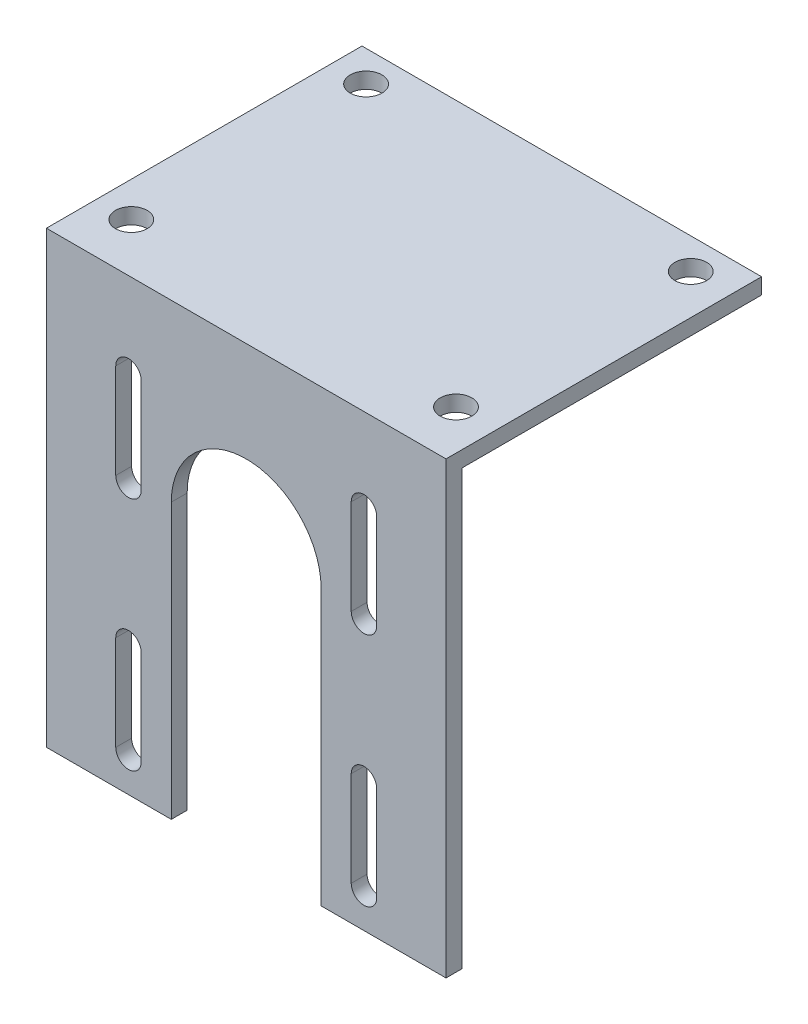
ISO-10303-21;
HEADER;
FILE_DESCRIPTION(('STEP AP214'),'2;1');
FILE_NAME('part.step','',(''),(''),'','','');
FILE_SCHEMA(('AUTOMOTIVE_DESIGN { 1 0 10303 214 1 1 1 1 }'));
ENDSEC;
DATA;
#1=APPLICATION_CONTEXT('core data for automotive mechanical design processes');
#2=APPLICATION_PROTOCOL_DEFINITION('international standard','automotive_design',2000,#1);
#3=PRODUCT_CONTEXT('',#1,'mechanical');
#4=PRODUCT('Part','Part','',(#3));
#5=PRODUCT_RELATED_PRODUCT_CATEGORY('part','',(#4));
#6=PRODUCT_DEFINITION_FORMATION('','',#4);
#7=PRODUCT_DEFINITION_CONTEXT('part definition',#1,'design');
#8=PRODUCT_DEFINITION('design','',#6,#7);
#9=PRODUCT_DEFINITION_SHAPE('','',#8);
#10=(LENGTH_UNIT() NAMED_UNIT(*) SI_UNIT(.MILLI.,.METRE.));
#11=(NAMED_UNIT(*) PLANE_ANGLE_UNIT() SI_UNIT($,.RADIAN.));
#12=(NAMED_UNIT(*) SI_UNIT($,.STERADIAN.) SOLID_ANGLE_UNIT());
#13=UNCERTAINTY_MEASURE_WITH_UNIT(LENGTH_MEASURE(1.E-05),#10,'distance_accuracy_value','');
#14=(GEOMETRIC_REPRESENTATION_CONTEXT(3) GLOBAL_UNCERTAINTY_ASSIGNED_CONTEXT((#13)) GLOBAL_UNIT_ASSIGNED_CONTEXT((#10,
#11,#12)) REPRESENTATION_CONTEXT('',''));
#15=CARTESIAN_POINT('',(0.,0.,0.));
#16=DIRECTION('',(0.,0.,1.));
#17=DIRECTION('',(1.,0.,0.));
#18=AXIS2_PLACEMENT_3D('',#15,#16,#17);
#19=CARTESIAN_POINT('',(0.,0.,3.175));
#20=DIRECTION('',(0.,0.,-1.));
#21=DIRECTION('',(-1.,0.,0.));
#22=AXIS2_PLACEMENT_3D('',#19,#20,#21);
#23=PLANE('',#22);
#24=CARTESIAN_POINT('',(16.43,-83.07,3.175));
#25=DIRECTION('',(0.,0.,1.));
#26=DIRECTION('',(-1.,0.,0.));
#27=AXIS2_PLACEMENT_3D('',#24,#25,#26);
#28=CIRCLE('',#27,2.54999999999997);
#29=CARTESIAN_POINT('',(13.88,-83.07,3.175));
#30=VERTEX_POINT('',#29);
#31=CARTESIAN_POINT('',(18.98,-83.07,3.175));
#32=VERTEX_POINT('',#31);
#33=EDGE_CURVE('E326',#30,#32,#28,.T.);
#34=ORIENTED_EDGE('',*,*,#33,.F.);
#35=DIRECTION('',(0.,-1.,0.));
#36=VECTOR('',#35,1.);
#37=CARTESIAN_POINT('',(13.88,-83.07,3.175));
#38=LINE('',#37,#36);
#39=CARTESIAN_POINT('',(13.88,-64.07,3.175));
#40=VERTEX_POINT('',#39);
#41=EDGE_CURVE('E334',#40,#30,#38,.T.);
#42=ORIENTED_EDGE('',*,*,#41,.F.);
#43=CARTESIAN_POINT('',(16.43,-64.07,3.175));
#44=DIRECTION('',(0.,0.,1.));
#45=DIRECTION('',(-1.,0.,0.));
#46=AXIS2_PLACEMENT_3D('',#43,#44,#45);
#47=CIRCLE('',#46,2.54999999999997);
#48=CARTESIAN_POINT('',(18.98,-64.07,3.175));
#49=VERTEX_POINT('',#48);
#50=EDGE_CURVE('E331',#49,#40,#47,.T.);
#51=ORIENTED_EDGE('',*,*,#50,.F.);
#52=DIRECTION('',(0.,1.,0.));
#53=VECTOR('',#52,1.);
#54=CARTESIAN_POINT('',(18.98,-83.07,3.175));
#55=LINE('',#54,#53);
#56=EDGE_CURVE('E328',#32,#49,#55,.T.);
#57=ORIENTED_EDGE('',*,*,#56,.F.);
#58=EDGE_LOOP('',(#34,#42,#51,#57));
#59=FACE_BOUND('',#58,.T.);
#60=CARTESIAN_POINT('',(16.43,-16.93,3.175));
#61=DIRECTION('',(0.,0.,1.));
#62=DIRECTION('',(1.,0.,0.));
#63=AXIS2_PLACEMENT_3D('',#60,#61,#62);
#64=CIRCLE('',#63,2.54999999999997);
#65=CARTESIAN_POINT('',(18.98,-16.93,3.175));
#66=VERTEX_POINT('',#65);
#67=CARTESIAN_POINT('',(13.88,-16.93,3.175));
#68=VERTEX_POINT('',#67);
#69=EDGE_CURVE('E388',#66,#68,#64,.T.);
#70=ORIENTED_EDGE('',*,*,#69,.F.);
#71=DIRECTION('',(0.,1.,0.));
#72=VECTOR('',#71,1.);
#73=CARTESIAN_POINT('',(18.98,-16.93,3.175));
#74=LINE('',#73,#72);
#75=CARTESIAN_POINT('',(18.98,-35.93,3.175));
#76=VERTEX_POINT('',#75);
#77=EDGE_CURVE('E396',#76,#66,#74,.T.);
#78=ORIENTED_EDGE('',*,*,#77,.F.);
#79=CARTESIAN_POINT('',(16.43,-35.93,3.175));
#80=DIRECTION('',(0.,0.,1.));
#81=DIRECTION('',(1.,0.,0.));
#82=AXIS2_PLACEMENT_3D('',#79,#80,#81);
#83=CIRCLE('',#82,2.54999999999997);
#84=CARTESIAN_POINT('',(13.88,-35.93,3.175));
#85=VERTEX_POINT('',#84);
#86=EDGE_CURVE('E393',#85,#76,#83,.T.);
#87=ORIENTED_EDGE('',*,*,#86,.F.);
#88=DIRECTION('',(0.,-1.,0.));
#89=VECTOR('',#88,1.);
#90=CARTESIAN_POINT('',(13.88,-16.93,3.175));
#91=LINE('',#90,#89);
#92=EDGE_CURVE('E390',#68,#85,#91,.T.);
#93=ORIENTED_EDGE('',*,*,#92,.F.);
#94=EDGE_LOOP('',(#70,#78,#87,#93));
#95=FACE_BOUND('',#94,.T.);
#96=DIRECTION('',(0.,-1.,0.));
#97=VECTOR('',#96,1.);
#98=CARTESIAN_POINT('',(0.,0.,3.175));
#99=LINE('',#98,#97);
#100=CARTESIAN_POINT('',(0.,0.,3.175));
#101=VERTEX_POINT('',#100);
#102=CARTESIAN_POINT('',(0.,-90.,3.175));
#103=VERTEX_POINT('',#102);
#104=EDGE_CURVE('E230',#101,#103,#99,.T.);
#105=ORIENTED_EDGE('',*,*,#104,.T.);
#106=DIRECTION('',(-1.,0.,0.));
#107=VECTOR('',#106,1.);
#108=CARTESIAN_POINT('',(0.,-90.,3.175));
#109=LINE('',#108,#107);
#110=CARTESIAN_POINT('',(25.,-90.,3.175));
#111=VERTEX_POINT('',#110);
#112=EDGE_CURVE('E223',#111,#103,#109,.T.);
#113=ORIENTED_EDGE('',*,*,#112,.F.);
#114=DIRECTION('',(0.,-1.,0.));
#115=VECTOR('',#114,1.);
#116=CARTESIAN_POINT('',(25.,-35.0000000000001,3.175));
#117=LINE('',#116,#115);
#118=CARTESIAN_POINT('',(25.,-35.0000000000001,3.175));
#119=VERTEX_POINT('',#118);
#120=EDGE_CURVE('E282',#119,#111,#117,.T.);
#121=ORIENTED_EDGE('',*,*,#120,.F.);
#122=CARTESIAN_POINT('',(40.,-35.0000000000001,3.175));
#123=DIRECTION('',(0.,0.,1.));
#124=DIRECTION('',(-1.,0.,0.));
#125=AXIS2_PLACEMENT_3D('',#122,#123,#124);
#126=CIRCLE('',#125,15.);
#127=CARTESIAN_POINT('',(55.,-35.,3.175));
#128=VERTEX_POINT('',#127);
#129=EDGE_CURVE('E279',#128,#119,#126,.T.);
#130=ORIENTED_EDGE('',*,*,#129,.F.);
#131=DIRECTION('',(0.,1.,0.));
#132=VECTOR('',#131,1.);
#133=CARTESIAN_POINT('',(55.,-35.,3.175));
#134=LINE('',#133,#132);
#135=CARTESIAN_POINT('',(55.,-90.,3.175));
#136=VERTEX_POINT('',#135);
#137=EDGE_CURVE('E222',#136,#128,#134,.T.);
#138=ORIENTED_EDGE('',*,*,#137,.F.);
#139=CARTESIAN_POINT('',(80.,-90.,3.175));
#140=VERTEX_POINT('',#139);
#141=EDGE_CURVE('E51',#140,#136,#109,.T.);
#142=ORIENTED_EDGE('',*,*,#141,.F.);
#143=DIRECTION('',(0.,1.,0.));
#144=VECTOR('',#143,1.);
#145=CARTESIAN_POINT('',(80.,-100.,3.175));
#146=LINE('',#145,#144);
#147=CARTESIAN_POINT('',(80.,0.,3.175));
#148=VERTEX_POINT('',#147);
#149=EDGE_CURVE('E219',#140,#148,#146,.T.);
#150=ORIENTED_EDGE('',*,*,#149,.T.);
#151=DIRECTION('',(-1.,0.,0.));
#152=VECTOR('',#151,1.);
#153=CARTESIAN_POINT('',(0.,0.,3.175));
#154=LINE('',#153,#152);
#155=EDGE_CURVE('E227',#148,#101,#154,.T.);
#156=ORIENTED_EDGE('',*,*,#155,.T.);
#157=EDGE_LOOP('',(#105,#113,#121,#130,#138,#142,#150,#156));
#158=FACE_BOUND('',#157,.T.);
#159=CARTESIAN_POINT('',(63.57,-16.93,3.175));
#160=DIRECTION('',(0.,0.,1.));
#161=DIRECTION('',(-1.,0.,0.));
#162=AXIS2_PLACEMENT_3D('',#159,#160,#161);
#163=CIRCLE('',#162,2.54999999999997);
#164=CARTESIAN_POINT('',(66.12,-16.93,3.175));
#165=VERTEX_POINT('',#164);
#166=CARTESIAN_POINT('',(61.02,-16.93,3.175));
#167=VERTEX_POINT('',#166);
#168=EDGE_CURVE('E357',#165,#167,#163,.T.);
#169=ORIENTED_EDGE('',*,*,#168,.F.);
#170=DIRECTION('',(0.,1.,0.));
#171=VECTOR('',#170,1.);
#172=CARTESIAN_POINT('',(66.12,-16.93,3.175));
#173=LINE('',#172,#171);
#174=CARTESIAN_POINT('',(66.12,-35.93,3.175));
#175=VERTEX_POINT('',#174);
#176=EDGE_CURVE('E365',#175,#165,#173,.T.);
#177=ORIENTED_EDGE('',*,*,#176,.F.);
#178=CARTESIAN_POINT('',(63.57,-35.93,3.175));
#179=DIRECTION('',(0.,0.,1.));
#180=DIRECTION('',(-1.,0.,0.));
#181=AXIS2_PLACEMENT_3D('',#178,#179,#180);
#182=CIRCLE('',#181,2.54999999999997);
#183=CARTESIAN_POINT('',(61.02,-35.93,3.175));
#184=VERTEX_POINT('',#183);
#185=EDGE_CURVE('E362',#184,#175,#182,.T.);
#186=ORIENTED_EDGE('',*,*,#185,.F.);
#187=DIRECTION('',(0.,-1.,0.));
#188=VECTOR('',#187,1.);
#189=CARTESIAN_POINT('',(61.02,-16.93,3.175));
#190=LINE('',#189,#188);
#191=EDGE_CURVE('E359',#167,#184,#190,.T.);
#192=ORIENTED_EDGE('',*,*,#191,.F.);
#193=EDGE_LOOP('',(#169,#177,#186,#192));
#194=FACE_BOUND('',#193,.T.);
#195=CARTESIAN_POINT('',(63.57,-83.07,3.175));
#196=DIRECTION('',(0.,0.,1.));
#197=DIRECTION('',(1.,0.,0.));
#198=AXIS2_PLACEMENT_3D('',#195,#196,#197);
#199=CIRCLE('',#198,2.54999999999997);
#200=CARTESIAN_POINT('',(61.02,-83.07,3.175));
#201=VERTEX_POINT('',#200);
#202=CARTESIAN_POINT('',(66.12,-83.07,3.175));
#203=VERTEX_POINT('',#202);
#204=EDGE_CURVE('E295',#201,#203,#199,.T.);
#205=ORIENTED_EDGE('',*,*,#204,.F.);
#206=DIRECTION('',(0.,-1.,0.));
#207=VECTOR('',#206,1.);
#208=CARTESIAN_POINT('',(61.02,-83.07,3.175));
#209=LINE('',#208,#207);
#210=CARTESIAN_POINT('',(61.02,-64.07,3.175));
#211=VERTEX_POINT('',#210);
#212=EDGE_CURVE('E303',#211,#201,#209,.T.);
#213=ORIENTED_EDGE('',*,*,#212,.F.);
#214=CARTESIAN_POINT('',(63.57,-64.07,3.175));
#215=DIRECTION('',(0.,0.,1.));
#216=DIRECTION('',(1.,0.,0.));
#217=AXIS2_PLACEMENT_3D('',#214,#215,#216);
#218=CIRCLE('',#217,2.54999999999997);
#219=CARTESIAN_POINT('',(66.12,-64.07,3.175));
#220=VERTEX_POINT('',#219);
#221=EDGE_CURVE('E300',#220,#211,#218,.T.);
#222=ORIENTED_EDGE('',*,*,#221,.F.);
#223=DIRECTION('',(0.,1.,0.));
#224=VECTOR('',#223,1.);
#225=CARTESIAN_POINT('',(66.12,-83.07,3.175));
#226=LINE('',#225,#224);
#227=EDGE_CURVE('E297',#203,#220,#226,.T.);
#228=ORIENTED_EDGE('',*,*,#227,.F.);
#229=EDGE_LOOP('',(#205,#213,#222,#228));
#230=FACE_BOUND('',#229,.T.);
#231=ADVANCED_FACE('F36',(#59,#95,#158,#194,#230),#23,.F.);
#232=CARTESIAN_POINT('',(0.,0.,0.));
#233=DIRECTION('',(0.,0.,-1.));
#234=DIRECTION('',(-1.,0.,0.));
#235=AXIS2_PLACEMENT_3D('',#232,#233,#234);
#236=PLANE('',#235);
#237=DIRECTION('',(1.,0.,0.));
#238=VECTOR('',#237,1.);
#239=CARTESIAN_POINT('',(0.,-90.,0.));
#240=LINE('',#239,#238);
#241=CARTESIAN_POINT('',(0.,-90.,0.));
#242=VERTEX_POINT('',#241);
#243=CARTESIAN_POINT('',(25.,-90.,0.));
#244=VERTEX_POINT('',#243);
#245=EDGE_CURVE('E59',#242,#244,#240,.T.);
#246=ORIENTED_EDGE('',*,*,#245,.F.);
#247=DIRECTION('',(0.,-1.,0.));
#248=VECTOR('',#247,1.);
#249=CARTESIAN_POINT('',(0.,0.,0.));
#250=LINE('',#249,#248);
#251=CARTESIAN_POINT('',(0.,-3.175,0.));
#252=VERTEX_POINT('',#251);
#253=EDGE_CURVE('E228',#252,#242,#250,.T.);
#254=ORIENTED_EDGE('',*,*,#253,.F.);
#255=DIRECTION('',(-1.,0.,0.));
#256=VECTOR('',#255,1.);
#257=CARTESIAN_POINT('',(80.,-3.175,0.));
#258=LINE('',#257,#256);
#259=CARTESIAN_POINT('',(80.,-3.175,0.));
#260=VERTEX_POINT('',#259);
#261=EDGE_CURVE('E261',#260,#252,#258,.T.);
#262=ORIENTED_EDGE('',*,*,#261,.F.);
#263=DIRECTION('',(0.,1.,0.));
#264=VECTOR('',#263,1.);
#265=CARTESIAN_POINT('',(80.,-100.,0.));
#266=LINE('',#265,#264);
#267=CARTESIAN_POINT('',(80.,-90.,0.));
#268=VERTEX_POINT('',#267);
#269=EDGE_CURVE('E233',#268,#260,#266,.T.);
#270=ORIENTED_EDGE('',*,*,#269,.F.);
#271=CARTESIAN_POINT('',(55.,-90.,0.));
#272=VERTEX_POINT('',#271);
#273=EDGE_CURVE('E209',#272,#268,#240,.T.);
#274=ORIENTED_EDGE('',*,*,#273,.F.);
#275=DIRECTION('',(0.,1.,0.));
#276=VECTOR('',#275,1.);
#277=CARTESIAN_POINT('',(55.,-35.,0.));
#278=LINE('',#277,#276);
#279=CARTESIAN_POINT('',(55.,-35.,0.));
#280=VERTEX_POINT('',#279);
#281=EDGE_CURVE('E277',#272,#280,#278,.T.);
#282=ORIENTED_EDGE('',*,*,#281,.T.);
#283=CARTESIAN_POINT('',(40.,-35.0000000000001,0.));
#284=DIRECTION('',(0.,0.,-1.));
#285=DIRECTION('',(-1.,0.,0.));
#286=AXIS2_PLACEMENT_3D('',#283,#284,#285);
#287=CIRCLE('',#286,15.);
#288=CARTESIAN_POINT('',(25.,-35.0000000000001,0.));
#289=VERTEX_POINT('',#288);
#290=EDGE_CURVE('E274',#280,#289,#287,.F.);
#291=ORIENTED_EDGE('',*,*,#290,.T.);
#292=DIRECTION('',(0.,-1.,0.));
#293=VECTOR('',#292,1.);
#294=CARTESIAN_POINT('',(25.,-35.0000000000001,0.));
#295=LINE('',#294,#293);
#296=EDGE_CURVE('E290',#289,#244,#295,.T.);
#297=ORIENTED_EDGE('',*,*,#296,.T.);
#298=EDGE_LOOP('',(#246,#254,#262,#270,#274,#282,#291,#297));
#299=FACE_BOUND('',#298,.T.);
#300=DIRECTION('',(0.,1.,0.));
#301=VECTOR('',#300,1.);
#302=CARTESIAN_POINT('',(18.98,-16.93,0.));
#303=LINE('',#302,#301);
#304=CARTESIAN_POINT('',(18.98,-35.93,0.));
#305=VERTEX_POINT('',#304);
#306=CARTESIAN_POINT('',(18.98,-16.93,0.));
#307=VERTEX_POINT('',#306);
#308=EDGE_CURVE('E391',#305,#307,#303,.T.);
#309=ORIENTED_EDGE('',*,*,#308,.T.);
#310=CARTESIAN_POINT('',(16.43,-16.93,0.));
#311=DIRECTION('',(0.,0.,1.));
#312=DIRECTION('',(1.,0.,0.));
#313=AXIS2_PLACEMENT_3D('',#310,#311,#312);
#314=CIRCLE('',#313,2.54999999999997);
#315=CARTESIAN_POINT('',(13.88,-16.93,0.));
#316=VERTEX_POINT('',#315);
#317=EDGE_CURVE('E387',#307,#316,#314,.T.);
#318=ORIENTED_EDGE('',*,*,#317,.T.);
#319=DIRECTION('',(0.,-1.,0.));
#320=VECTOR('',#319,1.);
#321=CARTESIAN_POINT('',(13.88,-16.93,0.));
#322=LINE('',#321,#320);
#323=CARTESIAN_POINT('',(13.88,-35.93,0.));
#324=VERTEX_POINT('',#323);
#325=EDGE_CURVE('E401',#316,#324,#322,.T.);
#326=ORIENTED_EDGE('',*,*,#325,.T.);
#327=CARTESIAN_POINT('',(16.43,-35.93,0.));
#328=DIRECTION('',(0.,0.,1.));
#329=DIRECTION('',(1.,0.,0.));
#330=AXIS2_PLACEMENT_3D('',#327,#328,#329);
#331=CIRCLE('',#330,2.54999999999997);
#332=EDGE_CURVE('E404',#324,#305,#331,.T.);
#333=ORIENTED_EDGE('',*,*,#332,.T.);
#334=EDGE_LOOP('',(#309,#318,#326,#333));
#335=FACE_BOUND('',#334,.T.);
#336=DIRECTION('',(0.,1.,0.));
#337=VECTOR('',#336,1.);
#338=CARTESIAN_POINT('',(66.12,-16.93,0.));
#339=LINE('',#338,#337);
#340=CARTESIAN_POINT('',(66.12,-35.93,0.));
#341=VERTEX_POINT('',#340);
#342=CARTESIAN_POINT('',(66.12,-16.93,0.));
#343=VERTEX_POINT('',#342);
#344=EDGE_CURVE('E360',#341,#343,#339,.T.);
#345=ORIENTED_EDGE('',*,*,#344,.T.);
#346=CARTESIAN_POINT('',(63.57,-16.93,0.));
#347=DIRECTION('',(0.,0.,1.));
#348=DIRECTION('',(-1.,0.,0.));
#349=AXIS2_PLACEMENT_3D('',#346,#347,#348);
#350=CIRCLE('',#349,2.54999999999997);
#351=CARTESIAN_POINT('',(61.02,-16.93,0.));
#352=VERTEX_POINT('',#351);
#353=EDGE_CURVE('E356',#343,#352,#350,.T.);
#354=ORIENTED_EDGE('',*,*,#353,.T.);
#355=DIRECTION('',(0.,-1.,0.));
#356=VECTOR('',#355,1.);
#357=CARTESIAN_POINT('',(61.02,-16.93,0.));
#358=LINE('',#357,#356);
#359=CARTESIAN_POINT('',(61.02,-35.93,0.));
#360=VERTEX_POINT('',#359);
#361=EDGE_CURVE('E370',#352,#360,#358,.T.);
#362=ORIENTED_EDGE('',*,*,#361,.T.);
#363=CARTESIAN_POINT('',(63.57,-35.93,0.));
#364=DIRECTION('',(0.,0.,1.));
#365=DIRECTION('',(-1.,0.,0.));
#366=AXIS2_PLACEMENT_3D('',#363,#364,#365);
#367=CIRCLE('',#366,2.54999999999997);
#368=EDGE_CURVE('E373',#360,#341,#367,.T.);
#369=ORIENTED_EDGE('',*,*,#368,.T.);
#370=EDGE_LOOP('',(#345,#354,#362,#369));
#371=FACE_BOUND('',#370,.T.);
#372=DIRECTION('',(0.,-1.,0.));
#373=VECTOR('',#372,1.);
#374=CARTESIAN_POINT('',(13.88,-83.07,0.));
#375=LINE('',#374,#373);
#376=CARTESIAN_POINT('',(13.88,-64.07,0.));
#377=VERTEX_POINT('',#376);
#378=CARTESIAN_POINT('',(13.88,-83.07,0.));
#379=VERTEX_POINT('',#378);
#380=EDGE_CURVE('E329',#377,#379,#375,.T.);
#381=ORIENTED_EDGE('',*,*,#380,.T.);
#382=CARTESIAN_POINT('',(16.43,-83.07,0.));
#383=DIRECTION('',(0.,0.,1.));
#384=DIRECTION('',(-1.,0.,0.));
#385=AXIS2_PLACEMENT_3D('',#382,#383,#384);
#386=CIRCLE('',#385,2.54999999999997);
#387=CARTESIAN_POINT('',(18.98,-83.07,0.));
#388=VERTEX_POINT('',#387);
#389=EDGE_CURVE('E325',#379,#388,#386,.T.);
#390=ORIENTED_EDGE('',*,*,#389,.T.);
#391=DIRECTION('',(0.,1.,0.));
#392=VECTOR('',#391,1.);
#393=CARTESIAN_POINT('',(18.98,-83.07,0.));
#394=LINE('',#393,#392);
#395=CARTESIAN_POINT('',(18.98,-64.07,0.));
#396=VERTEX_POINT('',#395);
#397=EDGE_CURVE('E339',#388,#396,#394,.T.);
#398=ORIENTED_EDGE('',*,*,#397,.T.);
#399=CARTESIAN_POINT('',(16.43,-64.07,0.));
#400=DIRECTION('',(0.,0.,1.));
#401=DIRECTION('',(-1.,0.,0.));
#402=AXIS2_PLACEMENT_3D('',#399,#400,#401);
#403=CIRCLE('',#402,2.54999999999997);
#404=EDGE_CURVE('E342',#396,#377,#403,.T.);
#405=ORIENTED_EDGE('',*,*,#404,.T.);
#406=EDGE_LOOP('',(#381,#390,#398,#405));
#407=FACE_BOUND('',#406,.T.);
#408=DIRECTION('',(0.,-1.,0.));
#409=VECTOR('',#408,1.);
#410=CARTESIAN_POINT('',(61.02,-83.07,0.));
#411=LINE('',#410,#409);
#412=CARTESIAN_POINT('',(61.02,-64.07,0.));
#413=VERTEX_POINT('',#412);
#414=CARTESIAN_POINT('',(61.02,-83.07,0.));
#415=VERTEX_POINT('',#414);
#416=EDGE_CURVE('E298',#413,#415,#411,.T.);
#417=ORIENTED_EDGE('',*,*,#416,.T.);
#418=CARTESIAN_POINT('',(63.57,-83.07,0.));
#419=DIRECTION('',(0.,0.,1.));
#420=DIRECTION('',(1.,0.,0.));
#421=AXIS2_PLACEMENT_3D('',#418,#419,#420);
#422=CIRCLE('',#421,2.54999999999997);
#423=CARTESIAN_POINT('',(66.12,-83.07,0.));
#424=VERTEX_POINT('',#423);
#425=EDGE_CURVE('E294',#415,#424,#422,.T.);
#426=ORIENTED_EDGE('',*,*,#425,.T.);
#427=DIRECTION('',(0.,1.,0.));
#428=VECTOR('',#427,1.);
#429=CARTESIAN_POINT('',(66.12,-83.07,0.));
#430=LINE('',#429,#428);
#431=CARTESIAN_POINT('',(66.12,-64.07,0.));
#432=VERTEX_POINT('',#431);
#433=EDGE_CURVE('E308',#424,#432,#430,.T.);
#434=ORIENTED_EDGE('',*,*,#433,.T.);
#435=CARTESIAN_POINT('',(63.57,-64.07,0.));
#436=DIRECTION('',(0.,0.,1.));
#437=DIRECTION('',(1.,0.,0.));
#438=AXIS2_PLACEMENT_3D('',#435,#436,#437);
#439=CIRCLE('',#438,2.54999999999997);
#440=EDGE_CURVE('E311',#432,#413,#439,.T.);
#441=ORIENTED_EDGE('',*,*,#440,.T.);
#442=EDGE_LOOP('',(#417,#426,#434,#441));
#443=FACE_BOUND('',#442,.T.);
#444=ADVANCED_FACE('F424',(#299,#335,#371,#407,#443),#236,.T.);
#445=CARTESIAN_POINT('',(80.,-100.,3.175));
#446=DIRECTION('',(-1.,0.,0.));
#447=DIRECTION('',(0.,0.,1.));
#448=AXIS2_PLACEMENT_3D('',#445,#446,#447);
#449=PLANE('',#448);
#450=ORIENTED_EDGE('',*,*,#149,.F.);
#451=DIRECTION('',(0.,0.,1.));
#452=VECTOR('',#451,1.);
#453=CARTESIAN_POINT('',(80.,-90.,-60.));
#454=LINE('',#453,#452);
#455=EDGE_CURVE('E206',#268,#140,#454,.T.);
#456=ORIENTED_EDGE('',*,*,#455,.F.);
#457=ORIENTED_EDGE('',*,*,#269,.T.);
#458=DIRECTION('',(0.,0.,1.));
#459=VECTOR('',#458,1.);
#460=CARTESIAN_POINT('',(80.,-3.175,-60.));
#461=LINE('',#460,#459);
#462=CARTESIAN_POINT('',(80.,-3.175,-60.));
#463=VERTEX_POINT('',#462);
#464=EDGE_CURVE('E259',#463,#260,#461,.T.);
#465=ORIENTED_EDGE('',*,*,#464,.F.);
#466=DIRECTION('',(0.,-1.,0.));
#467=VECTOR('',#466,1.);
#468=CARTESIAN_POINT('',(80.,0.,-60.));
#469=LINE('',#468,#467);
#470=CARTESIAN_POINT('',(80.,0.,-60.));
#471=VERTEX_POINT('',#470);
#472=EDGE_CURVE('E252',#471,#463,#469,.T.);
#473=ORIENTED_EDGE('',*,*,#472,.F.);
#474=DIRECTION('',(0.,0.,-1.));
#475=VECTOR('',#474,1.);
#476=CARTESIAN_POINT('',(80.,0.,3.175));
#477=LINE('',#476,#475);
#478=EDGE_CURVE('E44',#148,#471,#477,.T.);
#479=ORIENTED_EDGE('',*,*,#478,.F.);
#480=EDGE_LOOP('',(#450,#456,#457,#465,#473,#479));
#481=FACE_BOUND('',#480,.T.);
#482=ADVANCED_FACE('F38',(#481),#449,.F.);
#483=CARTESIAN_POINT('',(0.,0.,3.175));
#484=DIRECTION('',(0.,-1.,0.));
#485=DIRECTION('',(1.,0.,0.));
#486=AXIS2_PLACEMENT_3D('',#483,#484,#485);
#487=PLANE('',#486);
#488=CARTESIAN_POINT('',(7.00000000000001,0.,-6.825));
#489=DIRECTION('',(0.,1.,0.));
#490=DIRECTION('',(-1.,0.,0.));
#491=AXIS2_PLACEMENT_3D('',#488,#489,#490);
#492=CIRCLE('',#491,3.175);
#493=CARTESIAN_POINT('',(3.82500000000001,0.,-6.825));
#494=VERTEX_POINT('',#493);
#495=EDGE_CURVE('E466',#494,#494,#492,.T.);
#496=ORIENTED_EDGE('',*,*,#495,.F.);
#497=EDGE_LOOP('',(#496));
#498=FACE_BOUND('',#497,.T.);
#499=CARTESIAN_POINT('',(72.,0.,-53.825));
#500=DIRECTION('',(0.,1.,0.));
#501=DIRECTION('',(-1.,0.,0.));
#502=AXIS2_PLACEMENT_3D('',#499,#500,#501);
#503=CIRCLE('',#502,3.175);
#504=CARTESIAN_POINT('',(68.825,0.,-53.825));
#505=VERTEX_POINT('',#504);
#506=EDGE_CURVE('E470',#505,#505,#503,.T.);
#507=ORIENTED_EDGE('',*,*,#506,.F.);
#508=EDGE_LOOP('',(#507));
#509=FACE_BOUND('',#508,.T.);
#510=CARTESIAN_POINT('',(72.,0.,-6.825));
#511=DIRECTION('',(0.,1.,0.));
#512=DIRECTION('',(-1.,0.,0.));
#513=AXIS2_PLACEMENT_3D('',#510,#511,#512);
#514=CIRCLE('',#513,3.175);
#515=CARTESIAN_POINT('',(68.825,0.,-6.825));
#516=VERTEX_POINT('',#515);
#517=EDGE_CURVE('E474',#516,#516,#514,.T.);
#518=ORIENTED_EDGE('',*,*,#517,.F.);
#519=EDGE_LOOP('',(#518));
#520=FACE_BOUND('',#519,.T.);
#521=CARTESIAN_POINT('',(7.00000000000001,0.,-53.825));
#522=DIRECTION('',(0.,1.,0.));
#523=DIRECTION('',(-1.,0.,0.));
#524=AXIS2_PLACEMENT_3D('',#521,#522,#523);
#525=CIRCLE('',#524,3.175);
#526=CARTESIAN_POINT('',(3.82500000000001,0.,-53.825));
#527=VERTEX_POINT('',#526);
#528=EDGE_CURVE('E477',#527,#527,#525,.T.);
#529=ORIENTED_EDGE('',*,*,#528,.F.);
#530=EDGE_LOOP('',(#529));
#531=FACE_BOUND('',#530,.T.);
#532=ORIENTED_EDGE('',*,*,#478,.T.);
#533=DIRECTION('',(1.,0.,0.));
#534=VECTOR('',#533,1.);
#535=CARTESIAN_POINT('',(80.,0.,-60.));
#536=LINE('',#535,#534);
#537=CARTESIAN_POINT('',(0.,0.,-60.));
#538=VERTEX_POINT('',#537);
#539=EDGE_CURVE('E247',#538,#471,#536,.T.);
#540=ORIENTED_EDGE('',*,*,#539,.F.);
#541=DIRECTION('',(0.,0.,-1.));
#542=VECTOR('',#541,1.);
#543=CARTESIAN_POINT('',(0.,0.,3.175));
#544=LINE('',#543,#542);
#545=EDGE_CURVE('E240',#101,#538,#544,.T.);
#546=ORIENTED_EDGE('',*,*,#545,.F.);
#547=ORIENTED_EDGE('',*,*,#155,.F.);
#548=EDGE_LOOP('',(#532,#540,#546,#547));
#549=FACE_BOUND('',#548,.T.);
#550=ADVANCED_FACE('F245',(#498,#509,#520,#531,#549),#487,.F.);
#551=CARTESIAN_POINT('',(0.,0.,3.175));
#552=DIRECTION('',(1.,0.,0.));
#553=DIRECTION('',(0.,1.,0.));
#554=AXIS2_PLACEMENT_3D('',#551,#552,#553);
#555=PLANE('',#554);
#556=ORIENTED_EDGE('',*,*,#253,.T.);
#557=DIRECTION('',(0.,0.,1.));
#558=VECTOR('',#557,1.);
#559=CARTESIAN_POINT('',(0.,-90.,-60.));
#560=LINE('',#559,#558);
#561=EDGE_CURVE('E213',#242,#103,#560,.T.);
#562=ORIENTED_EDGE('',*,*,#561,.T.);
#563=ORIENTED_EDGE('',*,*,#104,.F.);
#564=ORIENTED_EDGE('',*,*,#545,.T.);
#565=DIRECTION('',(0.,1.,0.));
#566=VECTOR('',#565,1.);
#567=CARTESIAN_POINT('',(0.,0.,-60.));
#568=LINE('',#567,#566);
#569=CARTESIAN_POINT('',(0.,-3.175,-60.));
#570=VERTEX_POINT('',#569);
#571=EDGE_CURVE('E255',#570,#538,#568,.T.);
#572=ORIENTED_EDGE('',*,*,#571,.F.);
#573=DIRECTION('',(0.,0.,1.));
#574=VECTOR('',#573,1.);
#575=CARTESIAN_POINT('',(0.,-3.175,-60.));
#576=LINE('',#575,#574);
#577=EDGE_CURVE('E256',#570,#252,#576,.T.);
#578=ORIENTED_EDGE('',*,*,#577,.T.);
#579=EDGE_LOOP('',(#556,#562,#563,#564,#572,#578));
#580=FACE_BOUND('',#579,.T.);
#581=ADVANCED_FACE('F455',(#580),#555,.F.);
#582=CARTESIAN_POINT('',(16.43,-16.93,3.175));
#583=DIRECTION('',(0.,0.,-1.));
#584=DIRECTION('',(-1.,0.,0.));
#585=AXIS2_PLACEMENT_3D('',#582,#583,#584);
#586=CYLINDRICAL_SURFACE('',#585,2.54999999999997);
#587=ORIENTED_EDGE('',*,*,#317,.F.);
#588=DIRECTION('',(0.,0.,-1.));
#589=VECTOR('',#588,1.);
#590=CARTESIAN_POINT('',(18.98,-16.93,3.175));
#591=LINE('',#590,#589);
#592=EDGE_CURVE('E398',#66,#307,#591,.T.);
#593=ORIENTED_EDGE('',*,*,#592,.F.);
#594=ORIENTED_EDGE('',*,*,#69,.T.);
#595=DIRECTION('',(0.,0.,-1.));
#596=VECTOR('',#595,1.);
#597=CARTESIAN_POINT('',(13.88,-16.93,3.175));
#598=LINE('',#597,#596);
#599=EDGE_CURVE('E236',#68,#316,#598,.T.);
#600=ORIENTED_EDGE('',*,*,#599,.T.);
#601=EDGE_LOOP('',(#587,#593,#594,#600));
#602=FACE_BOUND('',#601,.T.);
#603=ADVANCED_FACE('F419',(#602),#586,.F.);
#604=CARTESIAN_POINT('',(13.88,-16.93,3.175));
#605=DIRECTION('',(1.,0.,0.));
#606=DIRECTION('',(0.,0.,-1.));
#607=AXIS2_PLACEMENT_3D('',#604,#605,#606);
#608=PLANE('',#607);
#609=ORIENTED_EDGE('',*,*,#325,.F.);
#610=ORIENTED_EDGE('',*,*,#599,.F.);
#611=ORIENTED_EDGE('',*,*,#92,.T.);
#612=DIRECTION('',(0.,0.,-1.));
#613=VECTOR('',#612,1.);
#614=CARTESIAN_POINT('',(13.88,-35.93,3.175));
#615=LINE('',#614,#613);
#616=EDGE_CURVE('E412',#85,#324,#615,.T.);
#617=ORIENTED_EDGE('',*,*,#616,.T.);
#618=EDGE_LOOP('',(#609,#610,#611,#617));
#619=FACE_BOUND('',#618,.T.);
#620=ADVANCED_FACE('F432',(#619),#608,.T.);
#621=CARTESIAN_POINT('',(16.43,-35.93,3.175));
#622=DIRECTION('',(0.,0.,-1.));
#623=DIRECTION('',(-1.,0.,0.));
#624=AXIS2_PLACEMENT_3D('',#621,#622,#623);
#625=CYLINDRICAL_SURFACE('',#624,2.54999999999997);
#626=ORIENTED_EDGE('',*,*,#332,.F.);
#627=ORIENTED_EDGE('',*,*,#616,.F.);
#628=ORIENTED_EDGE('',*,*,#86,.T.);
#629=DIRECTION('',(0.,0.,-1.));
#630=VECTOR('',#629,1.);
#631=CARTESIAN_POINT('',(18.98,-35.93,3.175));
#632=LINE('',#631,#630);
#633=EDGE_CURVE('E411',#76,#305,#632,.T.);
#634=ORIENTED_EDGE('',*,*,#633,.T.);
#635=EDGE_LOOP('',(#626,#627,#628,#634));
#636=FACE_BOUND('',#635,.T.);
#637=ADVANCED_FACE('F434',(#636),#625,.F.);
#638=CARTESIAN_POINT('',(18.98,-16.93,3.175));
#639=DIRECTION('',(-1.,0.,0.));
#640=DIRECTION('',(0.,0.,1.));
#641=AXIS2_PLACEMENT_3D('',#638,#639,#640);
#642=PLANE('',#641);
#643=ORIENTED_EDGE('',*,*,#308,.F.);
#644=ORIENTED_EDGE('',*,*,#633,.F.);
#645=ORIENTED_EDGE('',*,*,#77,.T.);
#646=ORIENTED_EDGE('',*,*,#592,.T.);
#647=EDGE_LOOP('',(#643,#644,#645,#646));
#648=FACE_BOUND('',#647,.T.);
#649=ADVANCED_FACE('F428',(#648),#642,.T.);
#650=CARTESIAN_POINT('',(63.57,-16.93,3.175));
#651=DIRECTION('',(0.,0.,-1.));
#652=DIRECTION('',(-1.,0.,0.));
#653=AXIS2_PLACEMENT_3D('',#650,#651,#652);
#654=CYLINDRICAL_SURFACE('',#653,2.54999999999997);
#655=ORIENTED_EDGE('',*,*,#353,.F.);
#656=DIRECTION('',(0.,0.,-1.));
#657=VECTOR('',#656,1.);
#658=CARTESIAN_POINT('',(66.12,-16.93,3.175));
#659=LINE('',#658,#657);
#660=EDGE_CURVE('E367',#165,#343,#659,.T.);
#661=ORIENTED_EDGE('',*,*,#660,.F.);
#662=ORIENTED_EDGE('',*,*,#168,.T.);
#663=DIRECTION('',(0.,0.,-1.));
#664=VECTOR('',#663,1.);
#665=CARTESIAN_POINT('',(61.02,-16.93,3.175));
#666=LINE('',#665,#664);
#667=EDGE_CURVE('E384',#167,#352,#666,.T.);
#668=ORIENTED_EDGE('',*,*,#667,.T.);
#669=EDGE_LOOP('',(#655,#661,#662,#668));
#670=FACE_BOUND('',#669,.T.);
#671=ADVANCED_FACE('F441',(#670),#654,.F.);
#672=CARTESIAN_POINT('',(61.02,-16.93,3.175));
#673=DIRECTION('',(1.,0.,0.));
#674=DIRECTION('',(0.,0.,-1.));
#675=AXIS2_PLACEMENT_3D('',#672,#673,#674);
#676=PLANE('',#675);
#677=ORIENTED_EDGE('',*,*,#361,.F.);
#678=ORIENTED_EDGE('',*,*,#667,.F.);
#679=ORIENTED_EDGE('',*,*,#191,.T.);
#680=DIRECTION('',(0.,0.,-1.));
#681=VECTOR('',#680,1.);
#682=CARTESIAN_POINT('',(61.02,-35.93,3.175));
#683=LINE('',#682,#681);
#684=EDGE_CURVE('E382',#184,#360,#683,.T.);
#685=ORIENTED_EDGE('',*,*,#684,.T.);
#686=EDGE_LOOP('',(#677,#678,#679,#685));
#687=FACE_BOUND('',#686,.T.);
#688=ADVANCED_FACE('F564',(#687),#676,.T.);
#689=CARTESIAN_POINT('',(63.57,-35.93,3.175));
#690=DIRECTION('',(0.,0.,-1.));
#691=DIRECTION('',(-1.,0.,0.));
#692=AXIS2_PLACEMENT_3D('',#689,#690,#691);
#693=CYLINDRICAL_SURFACE('',#692,2.54999999999997);
#694=ORIENTED_EDGE('',*,*,#368,.F.);
#695=ORIENTED_EDGE('',*,*,#684,.F.);
#696=ORIENTED_EDGE('',*,*,#185,.T.);
#697=DIRECTION('',(0.,0.,-1.));
#698=VECTOR('',#697,1.);
#699=CARTESIAN_POINT('',(66.12,-35.93,3.175));
#700=LINE('',#699,#698);
#701=EDGE_CURVE('E380',#175,#341,#700,.T.);
#702=ORIENTED_EDGE('',*,*,#701,.T.);
#703=EDGE_LOOP('',(#694,#695,#696,#702));
#704=FACE_BOUND('',#703,.T.);
#705=ADVANCED_FACE('F560',(#704),#693,.F.);
#706=CARTESIAN_POINT('',(66.12,-16.93,3.175));
#707=DIRECTION('',(-1.,0.,0.));
#708=DIRECTION('',(0.,0.,1.));
#709=AXIS2_PLACEMENT_3D('',#706,#707,#708);
#710=PLANE('',#709);
#711=ORIENTED_EDGE('',*,*,#344,.F.);
#712=ORIENTED_EDGE('',*,*,#701,.F.);
#713=ORIENTED_EDGE('',*,*,#176,.T.);
#714=ORIENTED_EDGE('',*,*,#660,.T.);
#715=EDGE_LOOP('',(#711,#712,#713,#714));
#716=FACE_BOUND('',#715,.T.);
#717=ADVANCED_FACE('F556',(#716),#710,.T.);
#718=CARTESIAN_POINT('',(16.43,-83.07,3.175));
#719=DIRECTION('',(0.,0.,-1.));
#720=DIRECTION('',(-1.,0.,0.));
#721=AXIS2_PLACEMENT_3D('',#718,#719,#720);
#722=CYLINDRICAL_SURFACE('',#721,2.54999999999997);
#723=ORIENTED_EDGE('',*,*,#389,.F.);
#724=DIRECTION('',(0.,0.,-1.));
#725=VECTOR('',#724,1.);
#726=CARTESIAN_POINT('',(13.88,-83.07,3.175));
#727=LINE('',#726,#725);
#728=EDGE_CURVE('E336',#30,#379,#727,.T.);
#729=ORIENTED_EDGE('',*,*,#728,.F.);
#730=ORIENTED_EDGE('',*,*,#33,.T.);
#731=DIRECTION('',(0.,0.,-1.));
#732=VECTOR('',#731,1.);
#733=CARTESIAN_POINT('',(18.98,-83.07,3.175));
#734=LINE('',#733,#732);
#735=EDGE_CURVE('E353',#32,#388,#734,.T.);
#736=ORIENTED_EDGE('',*,*,#735,.T.);
#737=EDGE_LOOP('',(#723,#729,#730,#736));
#738=FACE_BOUND('',#737,.T.);
#739=ADVANCED_FACE('F552',(#738),#722,.F.);
#740=CARTESIAN_POINT('',(18.98,-83.07,3.175));
#741=DIRECTION('',(-1.,0.,0.));
#742=DIRECTION('',(0.,0.,1.));
#743=AXIS2_PLACEMENT_3D('',#740,#741,#742);
#744=PLANE('',#743);
#745=ORIENTED_EDGE('',*,*,#397,.F.);
#746=ORIENTED_EDGE('',*,*,#735,.F.);
#747=ORIENTED_EDGE('',*,*,#56,.T.);
#748=DIRECTION('',(0.,0.,-1.));
#749=VECTOR('',#748,1.);
#750=CARTESIAN_POINT('',(18.98,-64.07,3.175));
#751=LINE('',#750,#749);
#752=EDGE_CURVE('E351',#49,#396,#751,.T.);
#753=ORIENTED_EDGE('',*,*,#752,.T.);
#754=EDGE_LOOP('',(#745,#746,#747,#753));
#755=FACE_BOUND('',#754,.T.);
#756=ADVANCED_FACE('F548',(#755),#744,.T.);
#757=CARTESIAN_POINT('',(16.43,-64.07,3.175));
#758=DIRECTION('',(0.,0.,-1.));
#759=DIRECTION('',(-1.,0.,0.));
#760=AXIS2_PLACEMENT_3D('',#757,#758,#759);
#761=CYLINDRICAL_SURFACE('',#760,2.54999999999997);
#762=ORIENTED_EDGE('',*,*,#404,.F.);
#763=ORIENTED_EDGE('',*,*,#752,.F.);
#764=ORIENTED_EDGE('',*,*,#50,.T.);
#765=DIRECTION('',(0.,0.,-1.));
#766=VECTOR('',#765,1.);
#767=CARTESIAN_POINT('',(13.88,-64.07,3.175));
#768=LINE('',#767,#766);
#769=EDGE_CURVE('E349',#40,#377,#768,.T.);
#770=ORIENTED_EDGE('',*,*,#769,.T.);
#771=EDGE_LOOP('',(#762,#763,#764,#770));
#772=FACE_BOUND('',#771,.T.);
#773=ADVANCED_FACE('F544',(#772),#761,.F.);
#774=CARTESIAN_POINT('',(13.88,-83.07,3.175));
#775=DIRECTION('',(1.,0.,0.));
#776=DIRECTION('',(0.,0.,-1.));
#777=AXIS2_PLACEMENT_3D('',#774,#775,#776);
#778=PLANE('',#777);
#779=ORIENTED_EDGE('',*,*,#380,.F.);
#780=ORIENTED_EDGE('',*,*,#769,.F.);
#781=ORIENTED_EDGE('',*,*,#41,.T.);
#782=ORIENTED_EDGE('',*,*,#728,.T.);
#783=EDGE_LOOP('',(#779,#780,#781,#782));
#784=FACE_BOUND('',#783,.T.);
#785=ADVANCED_FACE('F540',(#784),#778,.T.);
#786=CARTESIAN_POINT('',(63.57,-83.07,3.175));
#787=DIRECTION('',(0.,0.,-1.));
#788=DIRECTION('',(-1.,0.,0.));
#789=AXIS2_PLACEMENT_3D('',#786,#787,#788);
#790=CYLINDRICAL_SURFACE('',#789,2.54999999999997);
#791=ORIENTED_EDGE('',*,*,#425,.F.);
#792=DIRECTION('',(0.,0.,-1.));
#793=VECTOR('',#792,1.);
#794=CARTESIAN_POINT('',(61.02,-83.07,3.175));
#795=LINE('',#794,#793);
#796=EDGE_CURVE('E305',#201,#415,#795,.T.);
#797=ORIENTED_EDGE('',*,*,#796,.F.);
#798=ORIENTED_EDGE('',*,*,#204,.T.);
#799=DIRECTION('',(0.,0.,-1.));
#800=VECTOR('',#799,1.);
#801=CARTESIAN_POINT('',(66.12,-83.07,3.175));
#802=LINE('',#801,#800);
#803=EDGE_CURVE('E322',#203,#424,#802,.T.);
#804=ORIENTED_EDGE('',*,*,#803,.T.);
#805=EDGE_LOOP('',(#791,#797,#798,#804));
#806=FACE_BOUND('',#805,.T.);
#807=ADVANCED_FACE('F536',(#806),#790,.F.);
#808=CARTESIAN_POINT('',(66.12,-83.07,3.175));
#809=DIRECTION('',(-1.,0.,0.));
#810=DIRECTION('',(0.,0.,1.));
#811=AXIS2_PLACEMENT_3D('',#808,#809,#810);
#812=PLANE('',#811);
#813=ORIENTED_EDGE('',*,*,#433,.F.);
#814=ORIENTED_EDGE('',*,*,#803,.F.);
#815=ORIENTED_EDGE('',*,*,#227,.T.);
#816=DIRECTION('',(0.,0.,-1.));
#817=VECTOR('',#816,1.);
#818=CARTESIAN_POINT('',(66.12,-64.07,3.175));
#819=LINE('',#818,#817);
#820=EDGE_CURVE('E320',#220,#432,#819,.T.);
#821=ORIENTED_EDGE('',*,*,#820,.T.);
#822=EDGE_LOOP('',(#813,#814,#815,#821));
#823=FACE_BOUND('',#822,.T.);
#824=ADVANCED_FACE('F532',(#823),#812,.T.);
#825=CARTESIAN_POINT('',(63.57,-64.07,3.175));
#826=DIRECTION('',(0.,0.,-1.));
#827=DIRECTION('',(-1.,0.,0.));
#828=AXIS2_PLACEMENT_3D('',#825,#826,#827);
#829=CYLINDRICAL_SURFACE('',#828,2.54999999999997);
#830=ORIENTED_EDGE('',*,*,#440,.F.);
#831=ORIENTED_EDGE('',*,*,#820,.F.);
#832=ORIENTED_EDGE('',*,*,#221,.T.);
#833=DIRECTION('',(0.,0.,-1.));
#834=VECTOR('',#833,1.);
#835=CARTESIAN_POINT('',(61.02,-64.07,3.175));
#836=LINE('',#835,#834);
#837=EDGE_CURVE('E318',#211,#413,#836,.T.);
#838=ORIENTED_EDGE('',*,*,#837,.T.);
#839=EDGE_LOOP('',(#830,#831,#832,#838));
#840=FACE_BOUND('',#839,.T.);
#841=ADVANCED_FACE('F528',(#840),#829,.F.);
#842=CARTESIAN_POINT('',(61.02,-83.07,3.175));
#843=DIRECTION('',(1.,0.,0.));
#844=DIRECTION('',(0.,0.,-1.));
#845=AXIS2_PLACEMENT_3D('',#842,#843,#844);
#846=PLANE('',#845);
#847=ORIENTED_EDGE('',*,*,#416,.F.);
#848=ORIENTED_EDGE('',*,*,#837,.F.);
#849=ORIENTED_EDGE('',*,*,#212,.T.);
#850=ORIENTED_EDGE('',*,*,#796,.T.);
#851=EDGE_LOOP('',(#847,#848,#849,#850));
#852=FACE_BOUND('',#851,.T.);
#853=ADVANCED_FACE('F521',(#852),#846,.T.);
#854=CARTESIAN_POINT('',(40.,-35.0000000000001,-0.00100000000000013));
#855=DIRECTION('',(0.,0.,1.));
#856=DIRECTION('',(1.,0.,0.));
#857=AXIS2_PLACEMENT_3D('',#854,#855,#856);
#858=CYLINDRICAL_SURFACE('',#857,15.);
#859=DIRECTION('',(0.,0.,1.));
#860=VECTOR('',#859,1.);
#861=CARTESIAN_POINT('',(55.,-35.,-0.00100000000000013));
#862=LINE('',#861,#860);
#863=EDGE_CURVE('E287',#280,#128,#862,.T.);
#864=ORIENTED_EDGE('',*,*,#863,.T.);
#865=ORIENTED_EDGE('',*,*,#129,.T.);
#866=DIRECTION('',(0.,0.,1.));
#867=VECTOR('',#866,1.);
#868=CARTESIAN_POINT('',(25.,-35.0000000000001,-0.00100000000000013));
#869=LINE('',#868,#867);
#870=EDGE_CURVE('E286',#289,#119,#869,.T.);
#871=ORIENTED_EDGE('',*,*,#870,.F.);
#872=ORIENTED_EDGE('',*,*,#290,.F.);
#873=EDGE_LOOP('',(#864,#865,#871,#872));
#874=FACE_BOUND('',#873,.T.);
#875=ADVANCED_FACE('F509',(#874),#858,.F.);
#876=CARTESIAN_POINT('',(55.,-35.,-0.00100000000000013));
#877=DIRECTION('',(1.,0.,0.));
#878=DIRECTION('',(0.,1.,0.));
#879=AXIS2_PLACEMENT_3D('',#876,#877,#878);
#880=PLANE('',#879);
#881=ORIENTED_EDGE('',*,*,#281,.F.);
#882=DIRECTION('',(0.,0.,1.));
#883=VECTOR('',#882,1.);
#884=CARTESIAN_POINT('',(55.,-90.,-0.00100000000000013));
#885=LINE('',#884,#883);
#886=EDGE_CURVE('E493',#272,#136,#885,.T.);
#887=ORIENTED_EDGE('',*,*,#886,.T.);
#888=ORIENTED_EDGE('',*,*,#137,.T.);
#889=ORIENTED_EDGE('',*,*,#863,.F.);
#890=EDGE_LOOP('',(#881,#887,#888,#889));
#891=FACE_BOUND('',#890,.T.);
#892=ADVANCED_FACE('F513',(#891),#880,.F.);
#893=CARTESIAN_POINT('',(25.,-35.0000000000001,-0.00100000000000013));
#894=DIRECTION('',(-1.,0.,0.));
#895=DIRECTION('',(0.,-1.,0.));
#896=AXIS2_PLACEMENT_3D('',#893,#894,#895);
#897=PLANE('',#896);
#898=ORIENTED_EDGE('',*,*,#120,.T.);
#899=DIRECTION('',(0.,0.,-1.));
#900=VECTOR('',#899,1.);
#901=CARTESIAN_POINT('',(25.,-90.,-0.00100000000000013));
#902=LINE('',#901,#900);
#903=EDGE_CURVE('E11',#111,#244,#902,.T.);
#904=ORIENTED_EDGE('',*,*,#903,.T.);
#905=ORIENTED_EDGE('',*,*,#296,.F.);
#906=ORIENTED_EDGE('',*,*,#870,.T.);
#907=EDGE_LOOP('',(#898,#904,#905,#906));
#908=FACE_BOUND('',#907,.T.);
#909=ADVANCED_FACE('F507',(#908),#897,.F.);
#910=CARTESIAN_POINT('',(80.,-3.175,-60.));
#911=DIRECTION('',(0.,1.,0.));
#912=DIRECTION('',(0.,0.,1.));
#913=AXIS2_PLACEMENT_3D('',#910,#911,#912);
#914=PLANE('',#913);
#915=CARTESIAN_POINT('',(7.00000000000001,-3.175,-6.825));
#916=DIRECTION('',(0.,1.,0.));
#917=DIRECTION('',(0.,0.,1.));
#918=AXIS2_PLACEMENT_3D('',#915,#916,#917);
#919=CIRCLE('',#918,3.175);
#920=CARTESIAN_POINT('',(7.00000000000001,-3.175,-3.65));
#921=VERTEX_POINT('',#920);
#922=EDGE_CURVE('E479',#921,#921,#919,.F.);
#923=ORIENTED_EDGE('',*,*,#922,.F.);
#924=EDGE_LOOP('',(#923));
#925=FACE_BOUND('',#924,.T.);
#926=CARTESIAN_POINT('',(72.,-3.175,-53.825));
#927=DIRECTION('',(0.,1.,0.));
#928=DIRECTION('',(0.,0.,1.));
#929=AXIS2_PLACEMENT_3D('',#926,#927,#928);
#930=CIRCLE('',#929,3.175);
#931=CARTESIAN_POINT('',(72.,-3.175,-50.65));
#932=VERTEX_POINT('',#931);
#933=EDGE_CURVE('E484',#932,#932,#930,.F.);
#934=ORIENTED_EDGE('',*,*,#933,.F.);
#935=EDGE_LOOP('',(#934));
#936=FACE_BOUND('',#935,.T.);
#937=CARTESIAN_POINT('',(72.,-3.175,-6.825));
#938=DIRECTION('',(0.,1.,0.));
#939=DIRECTION('',(0.,0.,1.));
#940=AXIS2_PLACEMENT_3D('',#937,#938,#939);
#941=CIRCLE('',#940,3.175);
#942=CARTESIAN_POINT('',(72.,-3.175,-3.65));
#943=VERTEX_POINT('',#942);
#944=EDGE_CURVE('E487',#943,#943,#941,.F.);
#945=ORIENTED_EDGE('',*,*,#944,.F.);
#946=EDGE_LOOP('',(#945));
#947=FACE_BOUND('',#946,.T.);
#948=CARTESIAN_POINT('',(7.00000000000001,-3.175,-53.825));
#949=DIRECTION('',(0.,1.,0.));
#950=DIRECTION('',(0.,0.,1.));
#951=AXIS2_PLACEMENT_3D('',#948,#949,#950);
#952=CIRCLE('',#951,3.175);
#953=CARTESIAN_POINT('',(7.00000000000001,-3.175,-50.65));
#954=VERTEX_POINT('',#953);
#955=EDGE_CURVE('E265',#954,#954,#952,.F.);
#956=ORIENTED_EDGE('',*,*,#955,.F.);
#957=EDGE_LOOP('',(#956));
#958=FACE_BOUND('',#957,.T.);
#959=ORIENTED_EDGE('',*,*,#261,.T.);
#960=ORIENTED_EDGE('',*,*,#577,.F.);
#961=DIRECTION('',(-1.,0.,0.));
#962=VECTOR('',#961,1.);
#963=CARTESIAN_POINT('',(80.,-3.175,-60.));
#964=LINE('',#963,#962);
#965=EDGE_CURVE('E260',#463,#570,#964,.T.);
#966=ORIENTED_EDGE('',*,*,#965,.F.);
#967=ORIENTED_EDGE('',*,*,#464,.T.);
#968=EDGE_LOOP('',(#959,#960,#966,#967));
#969=FACE_BOUND('',#968,.T.);
#970=ADVANCED_FACE('F502',(#925,#936,#947,#958,#969),#914,.F.);
#971=CARTESIAN_POINT('',(0.,0.,-60.));
#972=DIRECTION('',(0.,0.,-1.));
#973=DIRECTION('',(-1.,0.,0.));
#974=AXIS2_PLACEMENT_3D('',#971,#972,#973);
#975=PLANE('',#974);
#976=ORIENTED_EDGE('',*,*,#472,.T.);
#977=ORIENTED_EDGE('',*,*,#965,.T.);
#978=ORIENTED_EDGE('',*,*,#571,.T.);
#979=ORIENTED_EDGE('',*,*,#539,.T.);
#980=EDGE_LOOP('',(#976,#977,#978,#979));
#981=FACE_BOUND('',#980,.T.);
#982=ADVANCED_FACE('F251',(#981),#975,.T.);
#983=CARTESIAN_POINT('',(7.00000000000001,-12.1552561210692,-53.825));
#984=DIRECTION('',(0.,1.,0.));
#985=DIRECTION('',(-1.,0.,0.));
#986=AXIS2_PLACEMENT_3D('',#983,#984,#985);
#987=CYLINDRICAL_SURFACE('',#986,3.175);
#988=ORIENTED_EDGE('',*,*,#955,.T.);
#989=EDGE_LOOP('',(#988));
#990=FACE_BOUND('',#989,.T.);
#991=ORIENTED_EDGE('',*,*,#528,.T.);
#992=EDGE_LOOP('',(#991));
#993=FACE_BOUND('',#992,.T.);
#994=ADVANCED_FACE('F661',(#990,#993),#987,.F.);
#995=CARTESIAN_POINT('',(72.,-12.1552561210691,-6.825));
#996=DIRECTION('',(0.,1.,0.));
#997=DIRECTION('',(-1.,0.,0.));
#998=AXIS2_PLACEMENT_3D('',#995,#996,#997);
#999=CYLINDRICAL_SURFACE('',#998,3.175);
#1000=ORIENTED_EDGE('',*,*,#944,.T.);
#1001=EDGE_LOOP('',(#1000));
#1002=FACE_BOUND('',#1001,.T.);
#1003=ORIENTED_EDGE('',*,*,#517,.T.);
#1004=EDGE_LOOP('',(#1003));
#1005=FACE_BOUND('',#1004,.T.);
#1006=ADVANCED_FACE('F685',(#1002,#1005),#999,.F.);
#1007=CARTESIAN_POINT('',(72.,-12.1552561210691,-53.825));
#1008=DIRECTION('',(0.,1.,0.));
#1009=DIRECTION('',(-1.,0.,0.));
#1010=AXIS2_PLACEMENT_3D('',#1007,#1008,#1009);
#1011=CYLINDRICAL_SURFACE('',#1010,3.175);
#1012=ORIENTED_EDGE('',*,*,#933,.T.);
#1013=EDGE_LOOP('',(#1012));
#1014=FACE_BOUND('',#1013,.T.);
#1015=ORIENTED_EDGE('',*,*,#506,.T.);
#1016=EDGE_LOOP('',(#1015));
#1017=FACE_BOUND('',#1016,.T.);
#1018=ADVANCED_FACE('F695',(#1014,#1017),#1011,.F.);
#1019=CARTESIAN_POINT('',(7.00000000000001,-12.1552561210692,-6.825));
#1020=DIRECTION('',(0.,1.,0.));
#1021=DIRECTION('',(-1.,0.,0.));
#1022=AXIS2_PLACEMENT_3D('',#1019,#1020,#1021);
#1023=CYLINDRICAL_SURFACE('',#1022,3.175);
#1024=ORIENTED_EDGE('',*,*,#922,.T.);
#1025=EDGE_LOOP('',(#1024));
#1026=FACE_BOUND('',#1025,.T.);
#1027=ORIENTED_EDGE('',*,*,#495,.T.);
#1028=EDGE_LOOP('',(#1027));
#1029=FACE_BOUND('',#1028,.T.);
#1030=ADVANCED_FACE('F705',(#1026,#1029),#1023,.F.);
#1031=CARTESIAN_POINT('',(0.,-90.,-60.));
#1032=DIRECTION('',(0.,1.,0.));
#1033=DIRECTION('',(0.,0.,1.));
#1034=AXIS2_PLACEMENT_3D('',#1031,#1032,#1033);
#1035=PLANE('',#1034);
#1036=ORIENTED_EDGE('',*,*,#245,.T.);
#1037=ORIENTED_EDGE('',*,*,#903,.F.);
#1038=ORIENTED_EDGE('',*,*,#112,.T.);
#1039=ORIENTED_EDGE('',*,*,#561,.F.);
#1040=EDGE_LOOP('',(#1036,#1037,#1038,#1039));
#1041=FACE_BOUND('',#1040,.T.);
#1042=ADVANCED_FACE('F714',(#1041),#1035,.F.);
#1043=ORIENTED_EDGE('',*,*,#273,.T.);
#1044=ORIENTED_EDGE('',*,*,#455,.T.);
#1045=ORIENTED_EDGE('',*,*,#141,.T.);
#1046=ORIENTED_EDGE('',*,*,#886,.F.);
#1047=EDGE_LOOP('',(#1043,#1044,#1045,#1046));
#1048=FACE_BOUND('',#1047,.T.);
#1049=ADVANCED_FACE('F207',(#1048),#1035,.F.);
#1050=CLOSED_SHELL('',(#231,#444,#482,#550,#581,#603,#620,#637,#649,#671,#688,#705,#717,#739,
#756,#773,#785,#807,#824,#841,#853,#875,#892,#909,#970,#982,#994,#1006,#1018,#1030,#1042,#1049));
#1051=MANIFOLD_SOLID_BREP('B2',#1050);
#1052=ADVANCED_BREP_SHAPE_REPRESENTATION('',(#18,#1051),#14);
#1053=SHAPE_DEFINITION_REPRESENTATION(#9,#1052);
ENDSEC;
END-ISO-10303-21;
